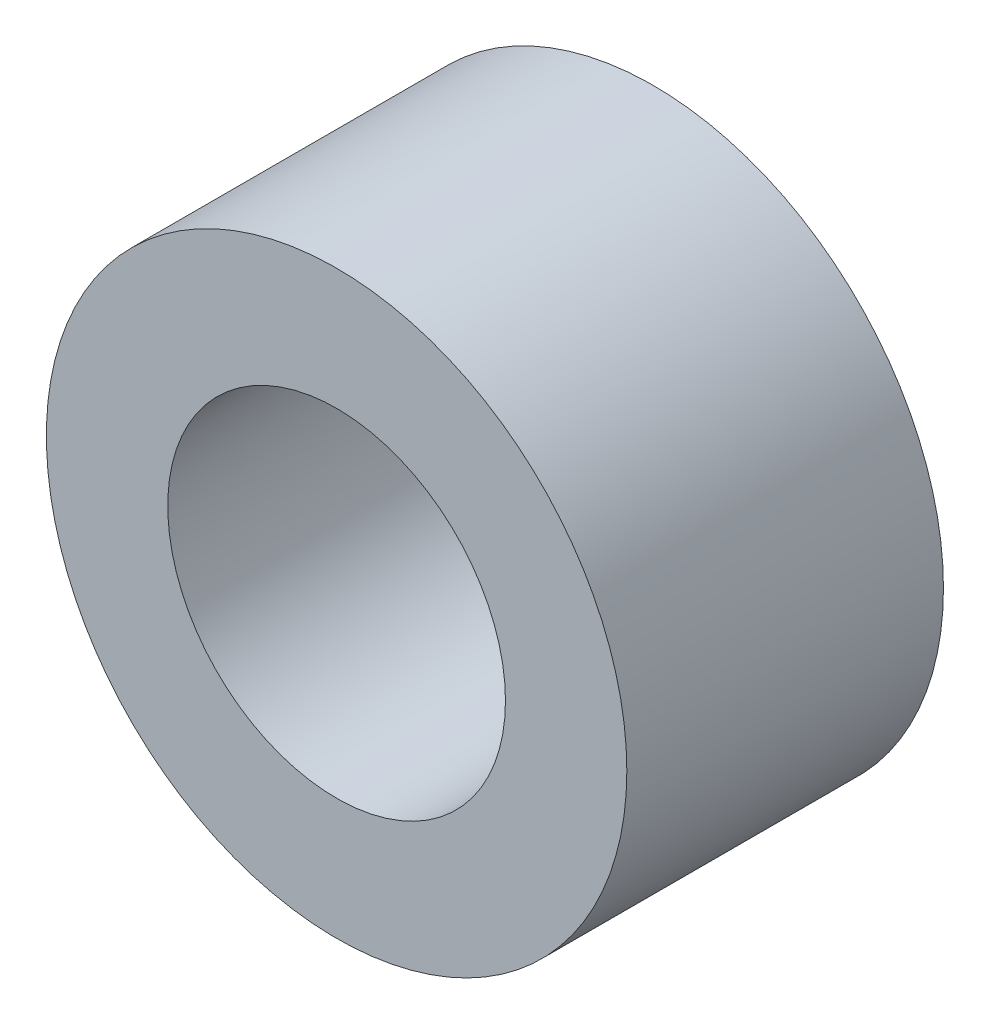
ISO-10303-21;
HEADER;
FILE_DESCRIPTION(('STEP AP214'),'2;1');
FILE_NAME('part.step','',(''),(''),'','','');
FILE_SCHEMA(('AUTOMOTIVE_DESIGN { 1 0 10303 214 1 1 1 1 }'));
ENDSEC;
DATA;
#1=APPLICATION_CONTEXT('core data for automotive mechanical design processes');
#2=APPLICATION_PROTOCOL_DEFINITION('international standard','automotive_design',2000,#1);
#3=PRODUCT_CONTEXT('',#1,'mechanical');
#4=PRODUCT('Part','Part','',(#3));
#5=PRODUCT_RELATED_PRODUCT_CATEGORY('part','',(#4));
#6=PRODUCT_DEFINITION_FORMATION('','',#4);
#7=PRODUCT_DEFINITION_CONTEXT('part definition',#1,'design');
#8=PRODUCT_DEFINITION('design','',#6,#7);
#9=PRODUCT_DEFINITION_SHAPE('','',#8);
#10=(LENGTH_UNIT() NAMED_UNIT(*) SI_UNIT(.MILLI.,.METRE.));
#11=(NAMED_UNIT(*) PLANE_ANGLE_UNIT() SI_UNIT($,.RADIAN.));
#12=(NAMED_UNIT(*) SI_UNIT($,.STERADIAN.) SOLID_ANGLE_UNIT());
#13=UNCERTAINTY_MEASURE_WITH_UNIT(LENGTH_MEASURE(1.E-05),#10,'distance_accuracy_value','');
#14=(GEOMETRIC_REPRESENTATION_CONTEXT(3) GLOBAL_UNCERTAINTY_ASSIGNED_CONTEXT((#13)) GLOBAL_UNIT_ASSIGNED_CONTEXT((#10,
#11,#12)) REPRESENTATION_CONTEXT('',''));
#15=CARTESIAN_POINT('',(0.,0.,0.));
#16=DIRECTION('',(0.,0.,1.));
#17=DIRECTION('',(1.,0.,0.));
#18=AXIS2_PLACEMENT_3D('',#15,#16,#17);
#19=CARTESIAN_POINT('',(0.,0.,3.));
#20=DIRECTION('',(0.,0.,1.));
#21=DIRECTION('',(1.,0.,0.));
#22=AXIS2_PLACEMENT_3D('',#19,#20,#21);
#23=PLANE('',#22);
#24=CARTESIAN_POINT('',(0.,0.,3.));
#25=DIRECTION('',(0.,0.,1.));
#26=DIRECTION('',(1.,0.,0.));
#27=AXIS2_PLACEMENT_3D('',#24,#25,#26);
#28=CIRCLE('',#27,2.75);
#29=CARTESIAN_POINT('',(2.75,0.,3.));
#30=VERTEX_POINT('',#29);
#31=EDGE_CURVE('E10',#30,#30,#28,.T.);
#32=ORIENTED_EDGE('',*,*,#31,.T.);
#33=EDGE_LOOP('',(#32));
#34=FACE_BOUND('',#33,.T.);
#35=CARTESIAN_POINT('',(0.,0.,3.));
#36=DIRECTION('',(0.,0.,1.));
#37=DIRECTION('',(1.,0.,0.));
#38=AXIS2_PLACEMENT_3D('',#35,#36,#37);
#39=CIRCLE('',#38,1.6);
#40=CARTESIAN_POINT('',(1.6,0.,3.));
#41=VERTEX_POINT('',#40);
#42=EDGE_CURVE('E42',#41,#41,#39,.T.);
#43=ORIENTED_EDGE('',*,*,#42,.F.);
#44=EDGE_LOOP('',(#43));
#45=FACE_BOUND('',#44,.T.);
#46=ADVANCED_FACE('F31',(#34,#45),#23,.T.);
#47=CARTESIAN_POINT('',(0.,0.,0.));
#48=DIRECTION('',(0.,0.,1.));
#49=DIRECTION('',(1.,0.,0.));
#50=AXIS2_PLACEMENT_3D('',#47,#48,#49);
#51=PLANE('',#50);
#52=CARTESIAN_POINT('',(0.,0.,0.));
#53=DIRECTION('',(0.,0.,1.));
#54=DIRECTION('',(1.,0.,0.));
#55=AXIS2_PLACEMENT_3D('',#52,#53,#54);
#56=CIRCLE('',#55,2.75);
#57=CARTESIAN_POINT('',(2.75,0.,0.));
#58=VERTEX_POINT('',#57);
#59=EDGE_CURVE('E35',#58,#58,#56,.T.);
#60=ORIENTED_EDGE('',*,*,#59,.F.);
#61=EDGE_LOOP('',(#60));
#62=FACE_BOUND('',#61,.T.);
#63=CARTESIAN_POINT('',(0.,0.,0.));
#64=DIRECTION('',(0.,0.,1.));
#65=DIRECTION('',(1.,0.,0.));
#66=AXIS2_PLACEMENT_3D('',#63,#64,#65);
#67=CIRCLE('',#66,1.6);
#68=CARTESIAN_POINT('',(1.6,0.,0.));
#69=VERTEX_POINT('',#68);
#70=EDGE_CURVE('E44',#69,#69,#67,.T.);
#71=ORIENTED_EDGE('',*,*,#70,.T.);
#72=EDGE_LOOP('',(#71));
#73=FACE_BOUND('',#72,.T.);
#74=ADVANCED_FACE('F54',(#62,#73),#51,.F.);
#75=CARTESIAN_POINT('',(0.,0.,3.));
#76=DIRECTION('',(0.,0.,-1.));
#77=DIRECTION('',(-1.,0.,0.));
#78=AXIS2_PLACEMENT_3D('',#75,#76,#77);
#79=CYLINDRICAL_SURFACE('',#78,2.75);
#80=ORIENTED_EDGE('',*,*,#31,.F.);
#81=EDGE_LOOP('',(#80));
#82=FACE_BOUND('',#81,.T.);
#83=ORIENTED_EDGE('',*,*,#59,.T.);
#84=EDGE_LOOP('',(#83));
#85=FACE_BOUND('',#84,.T.);
#86=ADVANCED_FACE('F33',(#82,#85),#79,.T.);
#87=CARTESIAN_POINT('',(0.,0.,3.));
#88=DIRECTION('',(0.,0.,-1.));
#89=DIRECTION('',(-1.,0.,0.));
#90=AXIS2_PLACEMENT_3D('',#87,#88,#89);
#91=CYLINDRICAL_SURFACE('',#90,1.6);
#92=ORIENTED_EDGE('',*,*,#42,.T.);
#93=EDGE_LOOP('',(#92));
#94=FACE_BOUND('',#93,.T.);
#95=ORIENTED_EDGE('',*,*,#70,.F.);
#96=EDGE_LOOP('',(#95));
#97=FACE_BOUND('',#96,.T.);
#98=ADVANCED_FACE('F50',(#94,#97),#91,.F.);
#99=CLOSED_SHELL('',(#46,#74,#86,#98));
#100=MANIFOLD_SOLID_BREP('B2',#99);
#101=ADVANCED_BREP_SHAPE_REPRESENTATION('',(#18,#100),#14);
#102=SHAPE_DEFINITION_REPRESENTATION(#9,#101);
ENDSEC;
END-ISO-10303-21;
